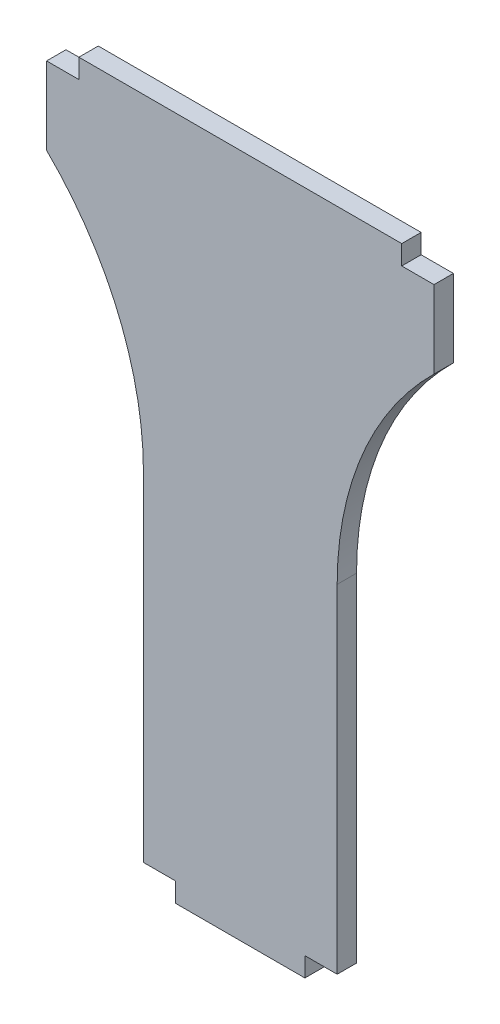
ISO-10303-21;
HEADER;
FILE_DESCRIPTION(('STEP AP214'),'2;1');
FILE_NAME('part.step','',(''),(''),'','','');
FILE_SCHEMA(('AUTOMOTIVE_DESIGN { 1 0 10303 214 1 1 1 1 }'));
ENDSEC;
DATA;
#1=APPLICATION_CONTEXT('core data for automotive mechanical design processes');
#2=APPLICATION_PROTOCOL_DEFINITION('international standard','automotive_design',2000,#1);
#3=PRODUCT_CONTEXT('',#1,'mechanical');
#4=PRODUCT('Part','Part','',(#3));
#5=PRODUCT_RELATED_PRODUCT_CATEGORY('part','',(#4));
#6=PRODUCT_DEFINITION_FORMATION('','',#4);
#7=PRODUCT_DEFINITION_CONTEXT('part definition',#1,'design');
#8=PRODUCT_DEFINITION('design','',#6,#7);
#9=PRODUCT_DEFINITION_SHAPE('','',#8);
#10=(LENGTH_UNIT() NAMED_UNIT(*) SI_UNIT(.MILLI.,.METRE.));
#11=(NAMED_UNIT(*) PLANE_ANGLE_UNIT() SI_UNIT($,.RADIAN.));
#12=(NAMED_UNIT(*) SI_UNIT($,.STERADIAN.) SOLID_ANGLE_UNIT());
#13=UNCERTAINTY_MEASURE_WITH_UNIT(LENGTH_MEASURE(1.E-05),#10,'distance_accuracy_value','');
#14=(GEOMETRIC_REPRESENTATION_CONTEXT(3) GLOBAL_UNCERTAINTY_ASSIGNED_CONTEXT((#13)) GLOBAL_UNIT_ASSIGNED_CONTEXT((#10,
#11,#12)) REPRESENTATION_CONTEXT('',''));
#15=CARTESIAN_POINT('',(0.,0.,0.));
#16=DIRECTION('',(0.,0.,1.));
#17=DIRECTION('',(1.,0.,0.));
#18=AXIS2_PLACEMENT_3D('',#15,#16,#17);
#19=CARTESIAN_POINT('',(15.,44.,1.5));
#20=DIRECTION('',(-1.,0.,0.));
#21=DIRECTION('',(0.,-1.,0.));
#22=AXIS2_PLACEMENT_3D('',#19,#20,#21);
#23=PLANE('',#22);
#24=DIRECTION('',(0.,1.,0.));
#25=VECTOR('',#24,1.);
#26=CARTESIAN_POINT('',(15.,44.,-1.5));
#27=LINE('',#26,#25);
#28=CARTESIAN_POINT('',(15.,-44.,-1.5));
#29=VERTEX_POINT('',#28);
#30=CARTESIAN_POINT('',(15.,8.29285785728573,-1.5));
#31=VERTEX_POINT('',#30);
#32=EDGE_CURVE('E295',#29,#31,#27,.T.);
#33=ORIENTED_EDGE('',*,*,#32,.T.);
#34=DIRECTION('',(0.,0.,1.));
#35=VECTOR('',#34,1.);
#36=CARTESIAN_POINT('',(15.,8.29285785728573,1.5));
#37=LINE('',#36,#35);
#38=CARTESIAN_POINT('',(15.,8.29285785728573,1.5));
#39=VERTEX_POINT('',#38);
#40=EDGE_CURVE('E50',#31,#39,#37,.T.);
#41=ORIENTED_EDGE('',*,*,#40,.T.);
#42=DIRECTION('',(0.,1.,0.));
#43=VECTOR('',#42,1.);
#44=CARTESIAN_POINT('',(15.,44.,1.5));
#45=LINE('',#44,#43);
#46=CARTESIAN_POINT('',(15.,-44.,1.5));
#47=VERTEX_POINT('',#46);
#48=EDGE_CURVE('E151',#47,#39,#45,.T.);
#49=ORIENTED_EDGE('',*,*,#48,.F.);
#50=DIRECTION('',(0.,0.,-1.));
#51=VECTOR('',#50,1.);
#52=CARTESIAN_POINT('',(15.,-44.,1.5));
#53=LINE('',#52,#51);
#54=EDGE_CURVE('E224',#47,#29,#53,.T.);
#55=ORIENTED_EDGE('',*,*,#54,.T.);
#56=EDGE_LOOP('',(#33,#41,#49,#55));
#57=FACE_BOUND('',#56,.T.);
#58=ADVANCED_FACE('F35',(#57),#23,.F.);
#59=CARTESIAN_POINT('',(30.,56.,1.5));
#60=DIRECTION('',(-1.,0.,0.));
#61=DIRECTION('',(0.,0.,1.));
#62=AXIS2_PLACEMENT_3D('',#59,#60,#61);
#63=PLANE('',#62);
#64=DIRECTION('',(0.,1.,0.));
#65=VECTOR('',#64,1.);
#66=CARTESIAN_POINT('',(30.,56.,-1.5));
#67=LINE('',#66,#65);
#68=CARTESIAN_POINT('',(30.,44.,-1.5));
#69=VERTEX_POINT('',#68);
#70=CARTESIAN_POINT('',(30.,56.,-1.5));
#71=VERTEX_POINT('',#70);
#72=EDGE_CURVE('E268',#69,#71,#67,.T.);
#73=ORIENTED_EDGE('',*,*,#72,.T.);
#74=DIRECTION('',(0.,0.,-1.));
#75=VECTOR('',#74,1.);
#76=CARTESIAN_POINT('',(30.,56.,1.5));
#77=LINE('',#76,#75);
#78=CARTESIAN_POINT('',(30.,56.,1.5));
#79=VERTEX_POINT('',#78);
#80=EDGE_CURVE('E159',#79,#71,#77,.T.);
#81=ORIENTED_EDGE('',*,*,#80,.F.);
#82=DIRECTION('',(0.,1.,0.));
#83=VECTOR('',#82,1.);
#84=CARTESIAN_POINT('',(30.,56.,1.5));
#85=LINE('',#84,#83);
#86=CARTESIAN_POINT('',(30.,44.,1.5));
#87=VERTEX_POINT('',#86);
#88=EDGE_CURVE('E149',#87,#79,#85,.T.);
#89=ORIENTED_EDGE('',*,*,#88,.F.);
#90=DIRECTION('',(0.,0.,-1.));
#91=VECTOR('',#90,1.);
#92=CARTESIAN_POINT('',(30.,44.,1.5));
#93=LINE('',#92,#91);
#94=EDGE_CURVE('E157',#87,#69,#93,.T.);
#95=ORIENTED_EDGE('',*,*,#94,.T.);
#96=EDGE_LOOP('',(#73,#81,#89,#95));
#97=FACE_BOUND('',#96,.T.);
#98=ADVANCED_FACE('F156',(#97),#63,.F.);
#99=CARTESIAN_POINT('',(25.,56.,1.5));
#100=DIRECTION('',(0.,-1.,0.));
#101=DIRECTION('',(0.,0.,-1.));
#102=AXIS2_PLACEMENT_3D('',#99,#100,#101);
#103=PLANE('',#102);
#104=DIRECTION('',(-1.,0.,0.));
#105=VECTOR('',#104,1.);
#106=CARTESIAN_POINT('',(25.,56.,-1.5));
#107=LINE('',#106,#105);
#108=CARTESIAN_POINT('',(25.,56.,-1.5));
#109=VERTEX_POINT('',#108);
#110=EDGE_CURVE('E263',#71,#109,#107,.T.);
#111=ORIENTED_EDGE('',*,*,#110,.T.);
#112=DIRECTION('',(0.,0.,-1.));
#113=VECTOR('',#112,1.);
#114=CARTESIAN_POINT('',(25.,56.,1.5));
#115=LINE('',#114,#113);
#116=CARTESIAN_POINT('',(25.,56.,1.5));
#117=VERTEX_POINT('',#116);
#118=EDGE_CURVE('E167',#117,#109,#115,.T.);
#119=ORIENTED_EDGE('',*,*,#118,.F.);
#120=DIRECTION('',(-1.,0.,0.));
#121=VECTOR('',#120,1.);
#122=CARTESIAN_POINT('',(25.,56.,1.5));
#123=LINE('',#122,#121);
#124=EDGE_CURVE('E161',#79,#117,#123,.T.);
#125=ORIENTED_EDGE('',*,*,#124,.F.);
#126=ORIENTED_EDGE('',*,*,#80,.T.);
#127=EDGE_LOOP('',(#111,#119,#125,#126));
#128=FACE_BOUND('',#127,.T.);
#129=ADVANCED_FACE('F296',(#128),#103,.F.);
#130=CARTESIAN_POINT('',(25.,59.,1.5));
#131=DIRECTION('',(-1.,0.,0.));
#132=DIRECTION('',(0.,0.,1.));
#133=AXIS2_PLACEMENT_3D('',#130,#131,#132);
#134=PLANE('',#133);
#135=DIRECTION('',(0.,1.,0.));
#136=VECTOR('',#135,1.);
#137=CARTESIAN_POINT('',(25.,59.,-1.5));
#138=LINE('',#137,#136);
#139=CARTESIAN_POINT('',(25.,59.,-1.5));
#140=VERTEX_POINT('',#139);
#141=EDGE_CURVE('E258',#109,#140,#138,.T.);
#142=ORIENTED_EDGE('',*,*,#141,.T.);
#143=DIRECTION('',(0.,0.,-1.));
#144=VECTOR('',#143,1.);
#145=CARTESIAN_POINT('',(25.,59.,1.5));
#146=LINE('',#145,#144);
#147=CARTESIAN_POINT('',(25.,59.,1.5));
#148=VERTEX_POINT('',#147);
#149=EDGE_CURVE('E249',#148,#140,#146,.T.);
#150=ORIENTED_EDGE('',*,*,#149,.F.);
#151=DIRECTION('',(0.,1.,0.));
#152=VECTOR('',#151,1.);
#153=CARTESIAN_POINT('',(25.,59.,1.5));
#154=LINE('',#153,#152);
#155=EDGE_CURVE('E259',#117,#148,#154,.T.);
#156=ORIENTED_EDGE('',*,*,#155,.F.);
#157=ORIENTED_EDGE('',*,*,#118,.T.);
#158=EDGE_LOOP('',(#142,#150,#156,#157));
#159=FACE_BOUND('',#158,.T.);
#160=ADVANCED_FACE('F256',(#159),#134,.F.);
#161=CARTESIAN_POINT('',(-25.,59.,1.5));
#162=DIRECTION('',(0.,-1.,0.));
#163=DIRECTION('',(0.,0.,-1.));
#164=AXIS2_PLACEMENT_3D('',#161,#162,#163);
#165=PLANE('',#164);
#166=DIRECTION('',(-1.,0.,0.));
#167=VECTOR('',#166,1.);
#168=CARTESIAN_POINT('',(-25.,59.,-1.5));
#169=LINE('',#168,#167);
#170=CARTESIAN_POINT('',(-25.,59.,-1.5));
#171=VERTEX_POINT('',#170);
#172=EDGE_CURVE('E265',#140,#171,#169,.T.);
#173=ORIENTED_EDGE('',*,*,#172,.T.);
#174=DIRECTION('',(0.,0.,-1.));
#175=VECTOR('',#174,1.);
#176=CARTESIAN_POINT('',(-25.,59.,1.5));
#177=LINE('',#176,#175);
#178=CARTESIAN_POINT('',(-25.,59.,1.5));
#179=VERTEX_POINT('',#178);
#180=EDGE_CURVE('E246',#179,#171,#177,.T.);
#181=ORIENTED_EDGE('',*,*,#180,.F.);
#182=DIRECTION('',(-1.,0.,0.));
#183=VECTOR('',#182,1.);
#184=CARTESIAN_POINT('',(-25.,59.,1.5));
#185=LINE('',#184,#183);
#186=EDGE_CURVE('E283',#148,#179,#185,.T.);
#187=ORIENTED_EDGE('',*,*,#186,.F.);
#188=ORIENTED_EDGE('',*,*,#149,.T.);
#189=EDGE_LOOP('',(#173,#181,#187,#188));
#190=FACE_BOUND('',#189,.T.);
#191=ADVANCED_FACE('F302',(#190),#165,.F.);
#192=CARTESIAN_POINT('',(-25.,59.,1.5));
#193=DIRECTION('',(1.,0.,0.));
#194=DIRECTION('',(0.,0.,-1.));
#195=AXIS2_PLACEMENT_3D('',#192,#193,#194);
#196=PLANE('',#195);
#197=DIRECTION('',(0.,-1.,0.));
#198=VECTOR('',#197,1.);
#199=CARTESIAN_POINT('',(-25.,59.,-1.5));
#200=LINE('',#199,#198);
#201=CARTESIAN_POINT('',(-25.,56.,-1.5));
#202=VERTEX_POINT('',#201);
#203=EDGE_CURVE('E211',#171,#202,#200,.T.);
#204=ORIENTED_EDGE('',*,*,#203,.T.);
#205=DIRECTION('',(0.,0.,-1.));
#206=VECTOR('',#205,1.);
#207=CARTESIAN_POINT('',(-25.,56.,1.5));
#208=LINE('',#207,#206);
#209=CARTESIAN_POINT('',(-25.,56.,1.5));
#210=VERTEX_POINT('',#209);
#211=EDGE_CURVE('E243',#210,#202,#208,.T.);
#212=ORIENTED_EDGE('',*,*,#211,.F.);
#213=DIRECTION('',(0.,-1.,0.));
#214=VECTOR('',#213,1.);
#215=CARTESIAN_POINT('',(-25.,59.,1.5));
#216=LINE('',#215,#214);
#217=EDGE_CURVE('E280',#179,#210,#216,.T.);
#218=ORIENTED_EDGE('',*,*,#217,.F.);
#219=ORIENTED_EDGE('',*,*,#180,.T.);
#220=EDGE_LOOP('',(#204,#212,#218,#219));
#221=FACE_BOUND('',#220,.T.);
#222=ADVANCED_FACE('F273',(#221),#196,.F.);
#223=CARTESIAN_POINT('',(-30.,56.,1.5));
#224=DIRECTION('',(0.,-1.,0.));
#225=DIRECTION('',(0.,0.,-1.));
#226=AXIS2_PLACEMENT_3D('',#223,#224,#225);
#227=PLANE('',#226);
#228=DIRECTION('',(-1.,0.,0.));
#229=VECTOR('',#228,1.);
#230=CARTESIAN_POINT('',(-30.,56.,-1.5));
#231=LINE('',#230,#229);
#232=CARTESIAN_POINT('',(-30.,56.,-1.5));
#233=VERTEX_POINT('',#232);
#234=EDGE_CURVE('E207',#202,#233,#231,.T.);
#235=ORIENTED_EDGE('',*,*,#234,.T.);
#236=DIRECTION('',(0.,0.,-1.));
#237=VECTOR('',#236,1.);
#238=CARTESIAN_POINT('',(-30.,56.,1.5));
#239=LINE('',#238,#237);
#240=CARTESIAN_POINT('',(-30.,56.,1.5));
#241=VERTEX_POINT('',#240);
#242=EDGE_CURVE('E206',#241,#233,#239,.T.);
#243=ORIENTED_EDGE('',*,*,#242,.F.);
#244=DIRECTION('',(-1.,0.,0.));
#245=VECTOR('',#244,1.);
#246=CARTESIAN_POINT('',(-30.,56.,1.5));
#247=LINE('',#246,#245);
#248=EDGE_CURVE('E279',#210,#241,#247,.T.);
#249=ORIENTED_EDGE('',*,*,#248,.F.);
#250=ORIENTED_EDGE('',*,*,#211,.T.);
#251=EDGE_LOOP('',(#235,#243,#249,#250));
#252=FACE_BOUND('',#251,.T.);
#253=ADVANCED_FACE('F278',(#252),#227,.F.);
#254=CARTESIAN_POINT('',(-30.,56.,1.5));
#255=DIRECTION('',(1.,0.,0.));
#256=DIRECTION('',(0.,0.,-1.));
#257=AXIS2_PLACEMENT_3D('',#254,#255,#256);
#258=PLANE('',#257);
#259=DIRECTION('',(0.,-1.,0.));
#260=VECTOR('',#259,1.);
#261=CARTESIAN_POINT('',(-30.,56.,-1.5));
#262=LINE('',#261,#260);
#263=CARTESIAN_POINT('',(-30.,44.,-1.5));
#264=VERTEX_POINT('',#263);
#265=EDGE_CURVE('E199',#233,#264,#262,.T.);
#266=ORIENTED_EDGE('',*,*,#265,.T.);
#267=DIRECTION('',(0.,0.,-1.));
#268=VECTOR('',#267,1.);
#269=CARTESIAN_POINT('',(-30.,44.,1.5));
#270=LINE('',#269,#268);
#271=CARTESIAN_POINT('',(-30.,44.,1.5));
#272=VERTEX_POINT('',#271);
#273=EDGE_CURVE('E194',#272,#264,#270,.T.);
#274=ORIENTED_EDGE('',*,*,#273,.F.);
#275=DIRECTION('',(0.,-1.,0.));
#276=VECTOR('',#275,1.);
#277=CARTESIAN_POINT('',(-30.,56.,1.5));
#278=LINE('',#277,#276);
#279=EDGE_CURVE('E180',#241,#272,#278,.T.);
#280=ORIENTED_EDGE('',*,*,#279,.F.);
#281=ORIENTED_EDGE('',*,*,#242,.T.);
#282=EDGE_LOOP('',(#266,#274,#280,#281));
#283=FACE_BOUND('',#282,.T.);
#284=ADVANCED_FACE('F204',(#283),#258,.F.);
#285=CARTESIAN_POINT('',(-15.,44.,1.5));
#286=DIRECTION('',(1.,0.,0.));
#287=DIRECTION('',(0.,1.,0.));
#288=AXIS2_PLACEMENT_3D('',#285,#286,#287);
#289=PLANE('',#288);
#290=DIRECTION('',(0.,-1.,0.));
#291=VECTOR('',#290,1.);
#292=CARTESIAN_POINT('',(-15.,44.,1.5));
#293=LINE('',#292,#291);
#294=CARTESIAN_POINT('',(-15.,8.29285785728574,1.5));
#295=VERTEX_POINT('',#294);
#296=CARTESIAN_POINT('',(-15.,-44.,1.5));
#297=VERTEX_POINT('',#296);
#298=EDGE_CURVE('E177',#295,#297,#293,.T.);
#299=ORIENTED_EDGE('',*,*,#298,.F.);
#300=DIRECTION('',(0.,0.,-1.));
#301=VECTOR('',#300,1.);
#302=CARTESIAN_POINT('',(-15.,8.29285785728574,1.5));
#303=LINE('',#302,#301);
#304=CARTESIAN_POINT('',(-15.,8.29285785728574,-1.5));
#305=VERTEX_POINT('',#304);
#306=EDGE_CURVE('E163',#295,#305,#303,.T.);
#307=ORIENTED_EDGE('',*,*,#306,.T.);
#308=DIRECTION('',(0.,-1.,0.));
#309=VECTOR('',#308,1.);
#310=CARTESIAN_POINT('',(-15.,44.,-1.5));
#311=LINE('',#310,#309);
#312=CARTESIAN_POINT('',(-15.,-44.,-1.5));
#313=VERTEX_POINT('',#312);
#314=EDGE_CURVE('E201',#305,#313,#311,.T.);
#315=ORIENTED_EDGE('',*,*,#314,.T.);
#316=DIRECTION('',(0.,0.,-1.));
#317=VECTOR('',#316,1.);
#318=CARTESIAN_POINT('',(-15.,-44.,1.5));
#319=LINE('',#318,#317);
#320=EDGE_CURVE('E189',#297,#313,#319,.T.);
#321=ORIENTED_EDGE('',*,*,#320,.F.);
#322=EDGE_LOOP('',(#299,#307,#315,#321));
#323=FACE_BOUND('',#322,.T.);
#324=ADVANCED_FACE('F186',(#323),#289,.F.);
#325=CARTESIAN_POINT('',(-15.,-44.,1.5));
#326=DIRECTION('',(0.,1.,0.));
#327=DIRECTION('',(-1.,0.,0.));
#328=AXIS2_PLACEMENT_3D('',#325,#326,#327);
#329=PLANE('',#328);
#330=DIRECTION('',(1.,0.,0.));
#331=VECTOR('',#330,1.);
#332=CARTESIAN_POINT('',(-15.,-44.,-1.5));
#333=LINE('',#332,#331);
#334=CARTESIAN_POINT('',(-10.,-44.,-1.5));
#335=VERTEX_POINT('',#334);
#336=EDGE_CURVE('E209',#313,#335,#333,.T.);
#337=ORIENTED_EDGE('',*,*,#336,.T.);
#338=DIRECTION('',(0.,0.,-1.));
#339=VECTOR('',#338,1.);
#340=CARTESIAN_POINT('',(-10.,-44.,1.5));
#341=LINE('',#340,#339);
#342=CARTESIAN_POINT('',(-10.,-44.,1.5));
#343=VERTEX_POINT('',#342);
#344=EDGE_CURVE('E237',#343,#335,#341,.T.);
#345=ORIENTED_EDGE('',*,*,#344,.F.);
#346=DIRECTION('',(1.,0.,0.));
#347=VECTOR('',#346,1.);
#348=CARTESIAN_POINT('',(-15.,-44.,1.5));
#349=LINE('',#348,#347);
#350=EDGE_CURVE('E191',#297,#343,#349,.T.);
#351=ORIENTED_EDGE('',*,*,#350,.F.);
#352=ORIENTED_EDGE('',*,*,#320,.T.);
#353=EDGE_LOOP('',(#337,#345,#351,#352));
#354=FACE_BOUND('',#353,.T.);
#355=ADVANCED_FACE('F344',(#354),#329,.F.);
#356=CARTESIAN_POINT('',(-10.,-44.,1.5));
#357=DIRECTION('',(1.,0.,0.));
#358=DIRECTION('',(0.,0.,-1.));
#359=AXIS2_PLACEMENT_3D('',#356,#357,#358);
#360=PLANE('',#359);
#361=DIRECTION('',(0.,-1.,0.));
#362=VECTOR('',#361,1.);
#363=CARTESIAN_POINT('',(-10.,-44.,-1.5));
#364=LINE('',#363,#362);
#365=CARTESIAN_POINT('',(-10.,-47.,-1.5));
#366=VERTEX_POINT('',#365);
#367=EDGE_CURVE('E216',#335,#366,#364,.T.);
#368=ORIENTED_EDGE('',*,*,#367,.T.);
#369=DIRECTION('',(0.,0.,-1.));
#370=VECTOR('',#369,1.);
#371=CARTESIAN_POINT('',(-10.,-47.,1.5));
#372=LINE('',#371,#370);
#373=CARTESIAN_POINT('',(-10.,-47.,1.5));
#374=VERTEX_POINT('',#373);
#375=EDGE_CURVE('E234',#374,#366,#372,.T.);
#376=ORIENTED_EDGE('',*,*,#375,.F.);
#377=DIRECTION('',(0.,-1.,0.));
#378=VECTOR('',#377,1.);
#379=CARTESIAN_POINT('',(-10.,-44.,1.5));
#380=LINE('',#379,#378);
#381=EDGE_CURVE('E288',#343,#374,#380,.T.);
#382=ORIENTED_EDGE('',*,*,#381,.F.);
#383=ORIENTED_EDGE('',*,*,#344,.T.);
#384=EDGE_LOOP('',(#368,#376,#382,#383));
#385=FACE_BOUND('',#384,.T.);
#386=ADVANCED_FACE('F340',(#385),#360,.F.);
#387=CARTESIAN_POINT('',(-10.,-47.,1.5));
#388=DIRECTION('',(0.,1.,0.));
#389=DIRECTION('',(0.,0.,1.));
#390=AXIS2_PLACEMENT_3D('',#387,#388,#389);
#391=PLANE('',#390);
#392=DIRECTION('',(1.,0.,0.));
#393=VECTOR('',#392,1.);
#394=CARTESIAN_POINT('',(-10.,-47.,-1.5));
#395=LINE('',#394,#393);
#396=CARTESIAN_POINT('',(10.,-47.,-1.5));
#397=VERTEX_POINT('',#396);
#398=EDGE_CURVE('E218',#366,#397,#395,.T.);
#399=ORIENTED_EDGE('',*,*,#398,.T.);
#400=DIRECTION('',(0.,0.,-1.));
#401=VECTOR('',#400,1.);
#402=CARTESIAN_POINT('',(10.,-47.,1.5));
#403=LINE('',#402,#401);
#404=CARTESIAN_POINT('',(10.,-47.,1.5));
#405=VERTEX_POINT('',#404);
#406=EDGE_CURVE('E231',#405,#397,#403,.T.);
#407=ORIENTED_EDGE('',*,*,#406,.F.);
#408=DIRECTION('',(1.,0.,0.));
#409=VECTOR('',#408,1.);
#410=CARTESIAN_POINT('',(-10.,-47.,1.5));
#411=LINE('',#410,#409);
#412=EDGE_CURVE('E290',#374,#405,#411,.T.);
#413=ORIENTED_EDGE('',*,*,#412,.F.);
#414=ORIENTED_EDGE('',*,*,#375,.T.);
#415=EDGE_LOOP('',(#399,#407,#413,#414));
#416=FACE_BOUND('',#415,.T.);
#417=ADVANCED_FACE('F336',(#416),#391,.F.);
#418=CARTESIAN_POINT('',(10.,-44.,1.5));
#419=DIRECTION('',(-1.,0.,0.));
#420=DIRECTION('',(0.,0.,1.));
#421=AXIS2_PLACEMENT_3D('',#418,#419,#420);
#422=PLANE('',#421);
#423=DIRECTION('',(0.,1.,0.));
#424=VECTOR('',#423,1.);
#425=CARTESIAN_POINT('',(10.,-44.,-1.5));
#426=LINE('',#425,#424);
#427=CARTESIAN_POINT('',(10.,-44.,-1.5));
#428=VERTEX_POINT('',#427);
#429=EDGE_CURVE('E220',#397,#428,#426,.T.);
#430=ORIENTED_EDGE('',*,*,#429,.T.);
#431=DIRECTION('',(0.,0.,-1.));
#432=VECTOR('',#431,1.);
#433=CARTESIAN_POINT('',(10.,-44.,1.5));
#434=LINE('',#433,#432);
#435=CARTESIAN_POINT('',(10.,-44.,1.5));
#436=VERTEX_POINT('',#435);
#437=EDGE_CURVE('E227',#436,#428,#434,.T.);
#438=ORIENTED_EDGE('',*,*,#437,.F.);
#439=DIRECTION('',(0.,1.,0.));
#440=VECTOR('',#439,1.);
#441=CARTESIAN_POINT('',(10.,-44.,1.5));
#442=LINE('',#441,#440);
#443=EDGE_CURVE('E292',#405,#436,#442,.T.);
#444=ORIENTED_EDGE('',*,*,#443,.F.);
#445=ORIENTED_EDGE('',*,*,#406,.T.);
#446=EDGE_LOOP('',(#430,#438,#444,#445));
#447=FACE_BOUND('',#446,.T.);
#448=ADVANCED_FACE('F332',(#447),#422,.F.);
#449=CARTESIAN_POINT('',(10.,-44.,1.5));
#450=DIRECTION('',(0.,1.,0.));
#451=DIRECTION('',(-1.,0.,0.));
#452=AXIS2_PLACEMENT_3D('',#449,#450,#451);
#453=PLANE('',#452);
#454=DIRECTION('',(1.,0.,0.));
#455=VECTOR('',#454,1.);
#456=CARTESIAN_POINT('',(10.,-44.,-1.5));
#457=LINE('',#456,#455);
#458=EDGE_CURVE('E222',#428,#29,#457,.T.);
#459=ORIENTED_EDGE('',*,*,#458,.T.);
#460=ORIENTED_EDGE('',*,*,#54,.F.);
#461=DIRECTION('',(1.,0.,0.));
#462=VECTOR('',#461,1.);
#463=CARTESIAN_POINT('',(10.,-44.,1.5));
#464=LINE('',#463,#462);
#465=EDGE_CURVE('E228',#436,#47,#464,.T.);
#466=ORIENTED_EDGE('',*,*,#465,.F.);
#467=ORIENTED_EDGE('',*,*,#437,.T.);
#468=EDGE_LOOP('',(#459,#460,#466,#467));
#469=FACE_BOUND('',#468,.T.);
#470=ADVANCED_FACE('F327',(#469),#453,.F.);
#471=CARTESIAN_POINT('',(0.,0.,1.5));
#472=DIRECTION('',(0.,0.,1.));
#473=DIRECTION('',(1.,0.,0.));
#474=AXIS2_PLACEMENT_3D('',#471,#472,#473);
#475=PLANE('',#474);
#476=ORIENTED_EDGE('',*,*,#48,.T.);
#477=CARTESIAN_POINT('',(65.,8.29285785728574,1.5));
#478=DIRECTION('',(0.,0.,1.));
#479=DIRECTION('',(1.,0.,0.));
#480=AXIS2_PLACEMENT_3D('',#477,#478,#479);
#481=CIRCLE('',#480,50.);
#482=EDGE_CURVE('E11',#39,#87,#481,.F.);
#483=ORIENTED_EDGE('',*,*,#482,.T.);
#484=ORIENTED_EDGE('',*,*,#88,.T.);
#485=ORIENTED_EDGE('',*,*,#124,.T.);
#486=ORIENTED_EDGE('',*,*,#155,.T.);
#487=ORIENTED_EDGE('',*,*,#186,.T.);
#488=ORIENTED_EDGE('',*,*,#217,.T.);
#489=ORIENTED_EDGE('',*,*,#248,.T.);
#490=ORIENTED_EDGE('',*,*,#279,.T.);
#491=CARTESIAN_POINT('',(-65.,8.29285785728574,1.5));
#492=DIRECTION('',(0.,0.,1.));
#493=DIRECTION('',(1.,0.,0.));
#494=AXIS2_PLACEMENT_3D('',#491,#492,#493);
#495=CIRCLE('',#494,50.);
#496=EDGE_CURVE('E174',#272,#295,#495,.F.);
#497=ORIENTED_EDGE('',*,*,#496,.T.);
#498=ORIENTED_EDGE('',*,*,#298,.T.);
#499=ORIENTED_EDGE('',*,*,#350,.T.);
#500=ORIENTED_EDGE('',*,*,#381,.T.);
#501=ORIENTED_EDGE('',*,*,#412,.T.);
#502=ORIENTED_EDGE('',*,*,#443,.T.);
#503=ORIENTED_EDGE('',*,*,#465,.T.);
#504=EDGE_LOOP('',(#476,#483,#484,#485,#486,#487,#488,#489,#490,#497,#498,#499,#500,#501,#502,#503));
#505=FACE_BOUND('',#504,.T.);
#506=ADVANCED_FACE('F148',(#505),#475,.T.);
#507=CARTESIAN_POINT('',(0.,0.,-1.5));
#508=DIRECTION('',(0.,0.,1.));
#509=DIRECTION('',(1.,0.,0.));
#510=AXIS2_PLACEMENT_3D('',#507,#508,#509);
#511=PLANE('',#510);
#512=ORIENTED_EDGE('',*,*,#32,.F.);
#513=ORIENTED_EDGE('',*,*,#458,.F.);
#514=ORIENTED_EDGE('',*,*,#429,.F.);
#515=ORIENTED_EDGE('',*,*,#398,.F.);
#516=ORIENTED_EDGE('',*,*,#367,.F.);
#517=ORIENTED_EDGE('',*,*,#336,.F.);
#518=ORIENTED_EDGE('',*,*,#314,.F.);
#519=CARTESIAN_POINT('',(-65.,8.29285785728574,-1.5));
#520=DIRECTION('',(0.,0.,1.));
#521=DIRECTION('',(1.,0.,0.));
#522=AXIS2_PLACEMENT_3D('',#519,#520,#521);
#523=CIRCLE('',#522,50.);
#524=EDGE_CURVE('E172',#305,#264,#523,.T.);
#525=ORIENTED_EDGE('',*,*,#524,.T.);
#526=ORIENTED_EDGE('',*,*,#265,.F.);
#527=ORIENTED_EDGE('',*,*,#234,.F.);
#528=ORIENTED_EDGE('',*,*,#203,.F.);
#529=ORIENTED_EDGE('',*,*,#172,.F.);
#530=ORIENTED_EDGE('',*,*,#141,.F.);
#531=ORIENTED_EDGE('',*,*,#110,.F.);
#532=ORIENTED_EDGE('',*,*,#72,.F.);
#533=CARTESIAN_POINT('',(65.,8.29285785728574,-1.5));
#534=DIRECTION('',(0.,0.,1.));
#535=DIRECTION('',(1.,0.,0.));
#536=AXIS2_PLACEMENT_3D('',#533,#534,#535);
#537=CIRCLE('',#536,50.);
#538=EDGE_CURVE('E43',#69,#31,#537,.T.);
#539=ORIENTED_EDGE('',*,*,#538,.T.);
#540=EDGE_LOOP('',(#512,#513,#514,#515,#516,#517,#518,#525,#526,#527,#528,#529,#530,#531,#532,#539));
#541=FACE_BOUND('',#540,.T.);
#542=ADVANCED_FACE('F197',(#541),#511,.F.);
#543=CARTESIAN_POINT('',(-65.,8.29285785728574,1.5));
#544=DIRECTION('',(0.,0.,-1.));
#545=DIRECTION('',(-1.,0.,0.));
#546=AXIS2_PLACEMENT_3D('',#543,#544,#545);
#547=CYLINDRICAL_SURFACE('',#546,50.);
#548=ORIENTED_EDGE('',*,*,#496,.F.);
#549=ORIENTED_EDGE('',*,*,#273,.T.);
#550=ORIENTED_EDGE('',*,*,#524,.F.);
#551=ORIENTED_EDGE('',*,*,#306,.F.);
#552=EDGE_LOOP('',(#548,#549,#550,#551));
#553=FACE_BOUND('',#552,.T.);
#554=ADVANCED_FACE('F193',(#553),#547,.F.);
#555=CARTESIAN_POINT('',(65.,8.29285785728574,1.5));
#556=DIRECTION('',(0.,0.,1.));
#557=DIRECTION('',(1.,0.,0.));
#558=AXIS2_PLACEMENT_3D('',#555,#556,#557);
#559=CYLINDRICAL_SURFACE('',#558,50.);
#560=ORIENTED_EDGE('',*,*,#482,.F.);
#561=ORIENTED_EDGE('',*,*,#40,.F.);
#562=ORIENTED_EDGE('',*,*,#538,.F.);
#563=ORIENTED_EDGE('',*,*,#94,.F.);
#564=EDGE_LOOP('',(#560,#561,#562,#563));
#565=FACE_BOUND('',#564,.T.);
#566=ADVANCED_FACE('F37',(#565),#559,.F.);
#567=CLOSED_SHELL('',(#58,#98,#129,#160,#191,#222,#253,#284,#324,#355,#386,#417,#448,#470,#506,
#542,#554,#566));
#568=MANIFOLD_SOLID_BREP('B2',#567);
#569=ADVANCED_BREP_SHAPE_REPRESENTATION('',(#18,#568),#14);
#570=SHAPE_DEFINITION_REPRESENTATION(#9,#569);
ENDSEC;
END-ISO-10303-21;
